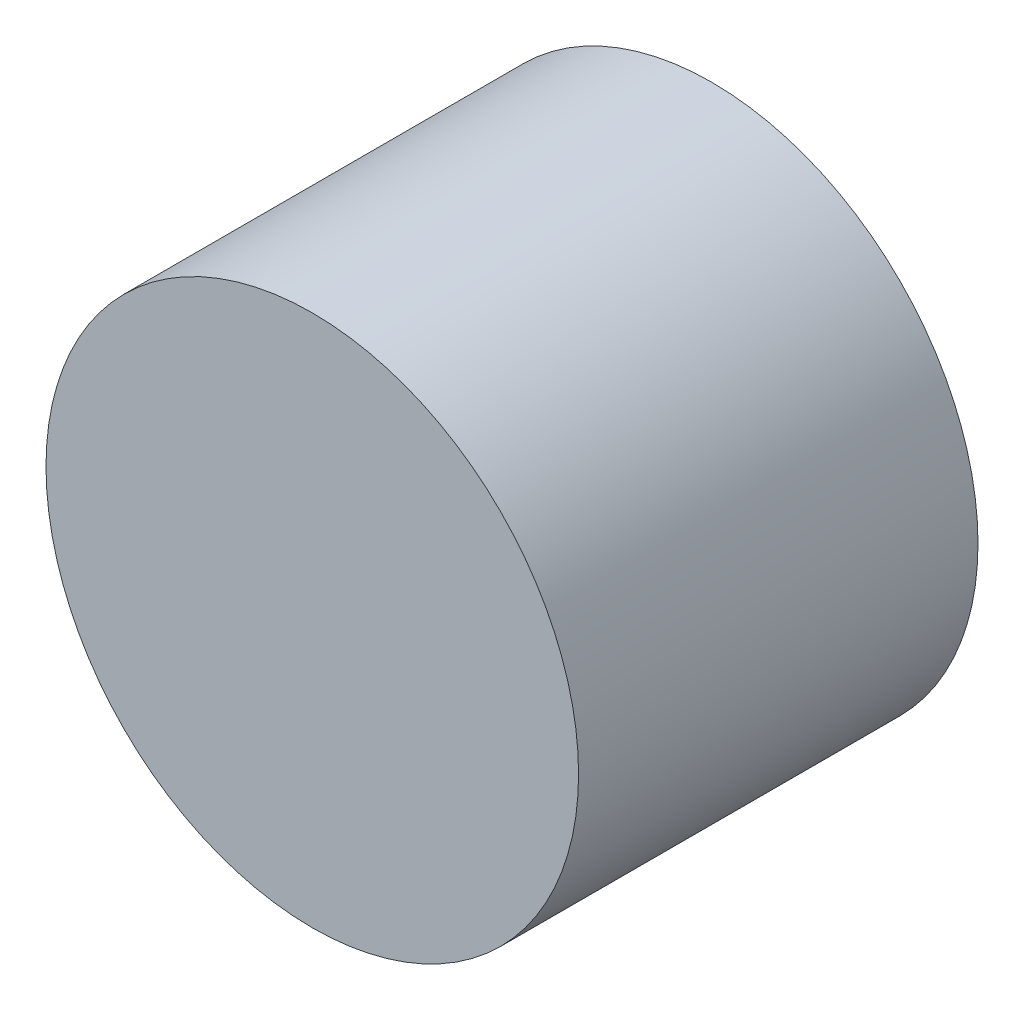
ISO-10303-21;
HEADER;
FILE_DESCRIPTION(('STEP AP214'),'2;1');
FILE_NAME('part.step','',(''),(''),'','','');
FILE_SCHEMA(('AUTOMOTIVE_DESIGN { 1 0 10303 214 1 1 1 1 }'));
ENDSEC;
DATA;
#1=APPLICATION_CONTEXT('core data for automotive mechanical design processes');
#2=APPLICATION_PROTOCOL_DEFINITION('international standard','automotive_design',2000,#1);
#3=PRODUCT_CONTEXT('',#1,'mechanical');
#4=PRODUCT('Part','Part','',(#3));
#5=PRODUCT_RELATED_PRODUCT_CATEGORY('part','',(#4));
#6=PRODUCT_DEFINITION_FORMATION('','',#4);
#7=PRODUCT_DEFINITION_CONTEXT('part definition',#1,'design');
#8=PRODUCT_DEFINITION('design','',#6,#7);
#9=PRODUCT_DEFINITION_SHAPE('','',#8);
#10=(LENGTH_UNIT() NAMED_UNIT(*) SI_UNIT(.MILLI.,.METRE.));
#11=(NAMED_UNIT(*) PLANE_ANGLE_UNIT() SI_UNIT($,.RADIAN.));
#12=(NAMED_UNIT(*) SI_UNIT($,.STERADIAN.) SOLID_ANGLE_UNIT());
#13=UNCERTAINTY_MEASURE_WITH_UNIT(LENGTH_MEASURE(1.E-05),#10,'distance_accuracy_value','');
#14=(GEOMETRIC_REPRESENTATION_CONTEXT(3) GLOBAL_UNCERTAINTY_ASSIGNED_CONTEXT((#13)) GLOBAL_UNIT_ASSIGNED_CONTEXT((#10,
#11,#12)) REPRESENTATION_CONTEXT('',''));
#15=CARTESIAN_POINT('',(0.,0.,0.));
#16=DIRECTION('',(0.,0.,1.));
#17=DIRECTION('',(1.,0.,0.));
#18=AXIS2_PLACEMENT_3D('',#15,#16,#17);
#19=CARTESIAN_POINT('',(0.,0.,15.));
#20=DIRECTION('',(0.,0.,-1.));
#21=DIRECTION('',(-1.,0.,0.));
#22=AXIS2_PLACEMENT_3D('',#19,#20,#21);
#23=CYLINDRICAL_SURFACE('',#22,10.);
#24=CARTESIAN_POINT('',(0.,0.,15.));
#25=DIRECTION('',(0.,0.,1.));
#26=DIRECTION('',(1.,0.,0.));
#27=AXIS2_PLACEMENT_3D('',#24,#25,#26);
#28=CIRCLE('',#27,10.);
#29=CARTESIAN_POINT('',(10.,0.,15.));
#30=VERTEX_POINT('',#29);
#31=EDGE_CURVE('E10',#30,#30,#28,.T.);
#32=ORIENTED_EDGE('',*,*,#31,.F.);
#33=EDGE_LOOP('',(#32));
#34=FACE_BOUND('',#33,.T.);
#35=CARTESIAN_POINT('',(0.,0.,0.));
#36=DIRECTION('',(0.,0.,1.));
#37=DIRECTION('',(1.,0.,0.));
#38=AXIS2_PLACEMENT_3D('',#35,#36,#37);
#39=CIRCLE('',#38,10.);
#40=CARTESIAN_POINT('',(10.,0.,0.));
#41=VERTEX_POINT('',#40);
#42=EDGE_CURVE('E34',#41,#41,#39,.T.);
#43=ORIENTED_EDGE('',*,*,#42,.T.);
#44=EDGE_LOOP('',(#43));
#45=FACE_BOUND('',#44,.T.);
#46=ADVANCED_FACE('F31',(#34,#45),#23,.T.);
#47=CARTESIAN_POINT('',(0.,0.,15.));
#48=DIRECTION('',(0.,0.,1.));
#49=DIRECTION('',(1.,0.,0.));
#50=AXIS2_PLACEMENT_3D('',#47,#48,#49);
#51=PLANE('',#50);
#52=ORIENTED_EDGE('',*,*,#31,.T.);
#53=EDGE_LOOP('',(#52));
#54=FACE_BOUND('',#53,.T.);
#55=ADVANCED_FACE('F46',(#54),#51,.T.);
#56=CARTESIAN_POINT('',(0.,0.,0.));
#57=DIRECTION('',(0.,0.,1.));
#58=DIRECTION('',(1.,0.,0.));
#59=AXIS2_PLACEMENT_3D('',#56,#57,#58);
#60=PLANE('',#59);
#61=ORIENTED_EDGE('',*,*,#42,.F.);
#62=EDGE_LOOP('',(#61));
#63=FACE_BOUND('',#62,.T.);
#64=ADVANCED_FACE('F44',(#63),#60,.F.);
#65=CLOSED_SHELL('',(#46,#55,#64));
#66=MANIFOLD_SOLID_BREP('B2',#65);
#67=ADVANCED_BREP_SHAPE_REPRESENTATION('',(#18,#66),#14);
#68=SHAPE_DEFINITION_REPRESENTATION(#9,#67);
ENDSEC;
END-ISO-10303-21;
